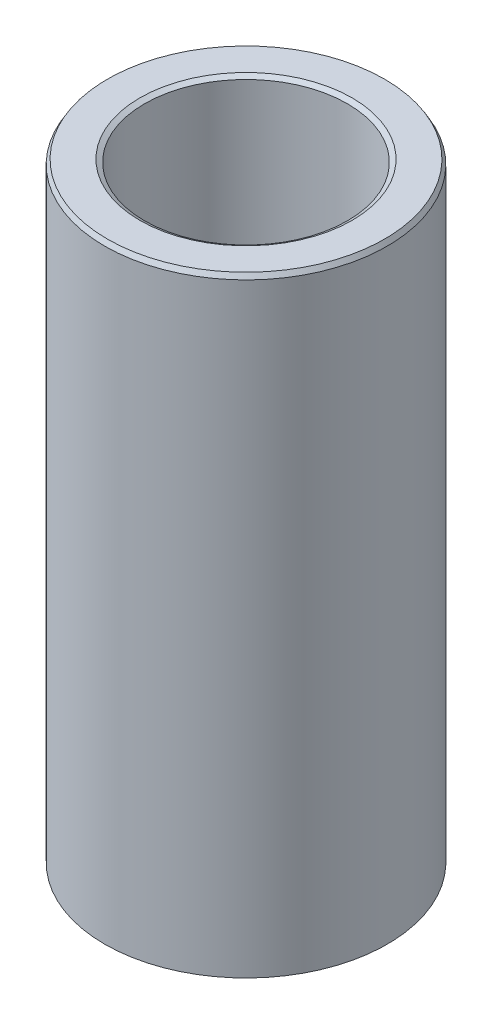
ISO-10303-21;
HEADER;
FILE_DESCRIPTION(('STEP AP214'),'2;1');
FILE_NAME('part.step','',(''),(''),'','','');
FILE_SCHEMA(('AUTOMOTIVE_DESIGN { 1 0 10303 214 1 1 1 1 }'));
ENDSEC;
DATA;
#1=APPLICATION_CONTEXT('core data for automotive mechanical design processes');
#2=APPLICATION_PROTOCOL_DEFINITION('international standard','automotive_design',2000,#1);
#3=PRODUCT_CONTEXT('',#1,'mechanical');
#4=PRODUCT('Part','Part','',(#3));
#5=PRODUCT_RELATED_PRODUCT_CATEGORY('part','',(#4));
#6=PRODUCT_DEFINITION_FORMATION('','',#4);
#7=PRODUCT_DEFINITION_CONTEXT('part definition',#1,'design');
#8=PRODUCT_DEFINITION('design','',#6,#7);
#9=PRODUCT_DEFINITION_SHAPE('','',#8);
#10=(LENGTH_UNIT() NAMED_UNIT(*) SI_UNIT(.MILLI.,.METRE.));
#11=(NAMED_UNIT(*) PLANE_ANGLE_UNIT() SI_UNIT($,.RADIAN.));
#12=(NAMED_UNIT(*) SI_UNIT($,.STERADIAN.) SOLID_ANGLE_UNIT());
#13=UNCERTAINTY_MEASURE_WITH_UNIT(LENGTH_MEASURE(1.E-05),#10,'distance_accuracy_value','');
#14=(GEOMETRIC_REPRESENTATION_CONTEXT(3) GLOBAL_UNCERTAINTY_ASSIGNED_CONTEXT((#13)) GLOBAL_UNIT_ASSIGNED_CONTEXT((#10,
#11,#12)) REPRESENTATION_CONTEXT('',''));
#15=CARTESIAN_POINT('',(0.,0.,0.));
#16=DIRECTION('',(0.,0.,1.));
#17=DIRECTION('',(1.,0.,0.));
#18=AXIS2_PLACEMENT_3D('',#15,#16,#17);
#19=CARTESIAN_POINT('',(0.,184.080786843945,0.));
#20=DIRECTION('',(0.,-1.,0.));
#21=DIRECTION('',(0.,0.,-1.));
#22=AXIS2_PLACEMENT_3D('',#19,#20,#21);
#23=CYLINDRICAL_SURFACE('',#22,42.5);
#24=CARTESIAN_POINT('',(0.,0.819974052406386,0.));
#25=DIRECTION('',(0.,1.,0.));
#26=DIRECTION('',(0.,0.,1.));
#27=AXIS2_PLACEMENT_3D('',#24,#25,#26);
#28=CIRCLE('',#27,42.5);
#29=CARTESIAN_POINT('',(0.,0.819974052406358,-42.5));
#30=VERTEX_POINT('',#29);
#31=EDGE_CURVE('E10',#30,#30,#28,.T.);
#32=CARTESIAN_POINT('',(0.,182.660550124289,0.));
#33=DIRECTION('',(0.,1.,0.));
#34=DIRECTION('',(0.,0.,1.));
#35=AXIS2_PLACEMENT_3D('',#32,#33,#34);
#36=CIRCLE('',#35,42.5);
#37=CARTESIAN_POINT('',(0.,182.660550124289,-42.5));
#38=VERTEX_POINT('',#37);
#39=EDGE_CURVE('E50',#38,#38,#36,.F.);
#40=CARTESIAN_POINT('',(0.,0.819974052406358,-42.5));
#41=CARTESIAN_POINT('',(0.,2.71414671982181,-42.5));
#42=CARTESIAN_POINT('',(0.,4.60831938723725,-42.5));
#43=CARTESIAN_POINT('',(0.,8.39666472206814,-42.5));
#44=CARTESIAN_POINT('',(0.,10.2908373894836,-42.5));
#45=CARTESIAN_POINT('',(0.,14.0791827243145,-42.5));
#46=CARTESIAN_POINT('',(0.,15.9733553917299,-42.5));
#47=CARTESIAN_POINT('',(0.,19.7617007265608,-42.5));
#48=CARTESIAN_POINT('',(0.,21.6558733939763,-42.5));
#49=CARTESIAN_POINT('',(0.,25.4442187288072,-42.5));
#50=CARTESIAN_POINT('',(0.,27.3383913962226,-42.5));
#51=CARTESIAN_POINT('',(0.,31.1267367310535,-42.5));
#52=CARTESIAN_POINT('',(0.,33.020909398469,-42.5));
#53=CARTESIAN_POINT('',(0.,36.8092547332999,-42.5));
#54=CARTESIAN_POINT('',(0.,38.7034274007153,-42.5));
#55=CARTESIAN_POINT('',(0.,42.4917727355462,-42.5));
#56=CARTESIAN_POINT('',(0.,44.3859454029617,-42.5));
#57=CARTESIAN_POINT('',(0.,48.1742907377926,-42.5));
#58=CARTESIAN_POINT('',(0.,50.068463405208,-42.5));
#59=CARTESIAN_POINT('',(0.,53.8568087400389,-42.5));
#60=CARTESIAN_POINT('',(0.,55.7509814074544,-42.5));
#61=CARTESIAN_POINT('',(0.,59.5393267422852,-42.5));
#62=CARTESIAN_POINT('',(0.,61.4334994097007,-42.5));
#63=CARTESIAN_POINT('',(0.,65.2218447445316,-42.5));
#64=CARTESIAN_POINT('',(0.,67.116017411947,-42.5));
#65=CARTESIAN_POINT('',(0.,70.9043627467779,-42.5));
#66=CARTESIAN_POINT('',(0.,72.7985354141934,-42.5));
#67=CARTESIAN_POINT('',(0.,76.5868807490243,-42.5));
#68=CARTESIAN_POINT('',(0.,78.4810534164397,-42.5));
#69=CARTESIAN_POINT('',(0.,82.2693987512706,-42.5));
#70=CARTESIAN_POINT('',(0.,84.1635714186861,-42.5));
#71=CARTESIAN_POINT('',(0.,87.951916753517,-42.5));
#72=CARTESIAN_POINT('',(0.,89.8460894209324,-42.5));
#73=CARTESIAN_POINT('',(0.,93.6344347557633,-42.5));
#74=CARTESIAN_POINT('',(0.,95.5286074231788,-42.5));
#75=CARTESIAN_POINT('',(0.,99.3169527580096,-42.5));
#76=CARTESIAN_POINT('',(0.,101.211125425425,-42.5));
#77=CARTESIAN_POINT('',(0.,104.999470760256,-42.5));
#78=CARTESIAN_POINT('',(0.,106.893643427671,-42.5));
#79=CARTESIAN_POINT('',(0.,110.681988762502,-42.5));
#80=CARTESIAN_POINT('',(0.,112.576161429918,-42.5));
#81=CARTESIAN_POINT('',(0.,116.364506764749,-42.5));
#82=CARTESIAN_POINT('',(0.,118.258679432164,-42.5));
#83=CARTESIAN_POINT('',(0.,122.047024766995,-42.5));
#84=CARTESIAN_POINT('',(0.,123.94119743441,-42.5));
#85=CARTESIAN_POINT('',(0.,127.729542769241,-42.5));
#86=CARTESIAN_POINT('',(0.,129.623715436657,-42.5));
#87=CARTESIAN_POINT('',(0.,133.412060771488,-42.5));
#88=CARTESIAN_POINT('',(0.,135.306233438903,-42.5));
#89=CARTESIAN_POINT('',(0.,139.094578773734,-42.5));
#90=CARTESIAN_POINT('',(0.,140.98875144115,-42.5));
#91=CARTESIAN_POINT('',(0.,144.77709677598,-42.5));
#92=CARTESIAN_POINT('',(0.,146.671269443396,-42.5));
#93=CARTESIAN_POINT('',(0.,150.459614778227,-42.5));
#94=CARTESIAN_POINT('',(0.,152.353787445642,-42.5));
#95=CARTESIAN_POINT('',(0.,156.142132780473,-42.5));
#96=CARTESIAN_POINT('',(0.,158.036305447889,-42.5));
#97=CARTESIAN_POINT('',(0.,161.824650782719,-42.5));
#98=CARTESIAN_POINT('',(0.,163.718823450135,-42.5));
#99=CARTESIAN_POINT('',(0.,167.507168784966,-42.5));
#100=CARTESIAN_POINT('',(0.,169.401341452381,-42.5));
#101=CARTESIAN_POINT('',(0.,173.189686787212,-42.5));
#102=CARTESIAN_POINT('',(0.,175.083859454628,-42.5));
#103=CARTESIAN_POINT('',(0.,178.872204789458,-42.5));
#104=CARTESIAN_POINT('',(0.,180.766377456874,-42.5));
#105=CARTESIAN_POINT('',(0.,182.660550124289,-42.5));
#106=B_SPLINE_CURVE_WITH_KNOTS('',3,(#40,#41,#42,#43,#44,#45,#46,#47,#48,#49,#50,#51,#52,#53,
#54,#55,#56,#57,#58,#59,#60,#61,#62,#63,#64,#65,#66,#67,#68,#69,#70,#71,#72,#73,#74,#75,#76,#77,
#78,#79,#80,#81,#82,#83,#84,#85,#86,#87,#88,#89,#90,#91,#92,#93,#94,#95,#96,#97,#98,#99,#100,
#101,#102,#103,#104,#105),.UNSPECIFIED.,.F.,.F.,(4,2,2,2,2,2,2,2,2,2,2,2,2,2,2,2,2,2,2,2,2,2,2,
2,2,2,2,2,2,2,2,2,4),(0.,5.68251800224634,11.3650360044927,17.047554006739,22.7300720089854,
28.4125900112317,34.0951080134781,39.7776260157244,45.4601440179708,51.1426620202171,
56.8251800224634,62.5076980247098,68.1902160269561,73.8727340292025,79.5552520314488,
85.2377700336952,90.9202880359415,96.6028060381878,102.285324040434,107.967842042681,
113.650360044927,119.332878047173,125.01539604942,130.697914051666,136.380432053912,
142.062950056159,147.745468058405,153.427986060651,159.110504062898,164.793022065144,
170.47554006739,176.158058069637,181.840576071883),.UNSPECIFIED.);
#107=EDGE_CURVE('BSEAM39',#30,#38,#106,.T.);
#108=ORIENTED_EDGE('',*,*,#31,.T.);
#109=ORIENTED_EDGE('',*,*,#39,.T.);
#110=ORIENTED_EDGE('',*,*,#107,.T.);
#111=ORIENTED_EDGE('',*,*,#107,.F.);
#112=EDGE_LOOP('',(#108,#110,#109,#111));
#113=FACE_BOUND('',#112,.T.);
#114=ADVANCED_FACE('F39',(#113),#23,.T.);
#115=CARTESIAN_POINT('',(0.,184.080786843945,0.));
#116=DIRECTION('',(0.,1.,0.));
#117=DIRECTION('',(0.,0.,1.));
#118=AXIS2_PLACEMENT_3D('',#115,#116,#117);
#119=PLANE('',#118);
#120=CARTESIAN_POINT('',(0.,184.080786843945,0.));
#121=DIRECTION('',(0.,1.,0.));
#122=DIRECTION('',(0.,0.,1.));
#123=AXIS2_PLACEMENT_3D('',#120,#121,#122);
#124=CIRCLE('',#123,31.9250883236727);
#125=CARTESIAN_POINT('',(0.,184.080786843945,31.9250883236727));
#126=VERTEX_POINT('',#125);
#127=EDGE_CURVE('E58',#126,#126,#124,.F.);
#128=ORIENTED_EDGE('',*,*,#127,.T.);
#129=EDGE_LOOP('',(#128));
#130=FACE_BOUND('',#129,.T.);
#131=CARTESIAN_POINT('',(0.,184.080786843945,0.));
#132=DIRECTION('',(0.,1.,0.));
#133=DIRECTION('',(0.,0.,1.));
#134=AXIS2_PLACEMENT_3D('',#131,#132,#133);
#135=CIRCLE('',#134,41.6800259475937);
#136=CARTESIAN_POINT('',(0.,184.080786843945,41.6800259475937));
#137=VERTEX_POINT('',#136);
#138=EDGE_CURVE('E61',#137,#137,#135,.T.);
#139=ORIENTED_EDGE('',*,*,#138,.T.);
#140=EDGE_LOOP('',(#139));
#141=FACE_BOUND('',#140,.T.);
#142=ADVANCED_FACE('F88',(#130,#141),#119,.T.);
#143=CARTESIAN_POINT('',(0.,0.,0.));
#144=DIRECTION('',(0.,1.,0.));
#145=DIRECTION('',(0.,0.,1.));
#146=AXIS2_PLACEMENT_3D('',#143,#144,#145);
#147=PLANE('',#146);
#148=CARTESIAN_POINT('',(0.,0.,0.));
#149=DIRECTION('',(0.,1.,0.));
#150=DIRECTION('',(0.,0.,1.));
#151=AXIS2_PLACEMENT_3D('',#148,#149,#150);
#152=CIRCLE('',#151,31.3248256564231);
#153=CARTESIAN_POINT('',(0.,0.,31.3248256564231));
#154=VERTEX_POINT('',#153);
#155=EDGE_CURVE('E51',#154,#154,#152,.T.);
#156=ORIENTED_EDGE('',*,*,#155,.T.);
#157=EDGE_LOOP('',(#156));
#158=FACE_BOUND('',#157,.T.);
#159=CARTESIAN_POINT('',(0.,0.,0.));
#160=DIRECTION('',(0.,1.,0.));
#161=DIRECTION('',(0.,0.,1.));
#162=AXIS2_PLACEMENT_3D('',#159,#160,#161);
#163=CIRCLE('',#162,41.079763280344);
#164=CARTESIAN_POINT('',(0.,0.,41.079763280344));
#165=VERTEX_POINT('',#164);
#166=EDGE_CURVE('E54',#165,#165,#163,.F.);
#167=ORIENTED_EDGE('',*,*,#166,.T.);
#168=EDGE_LOOP('',(#167));
#169=FACE_BOUND('',#168,.T.);
#170=ADVANCED_FACE('F83',(#158,#169),#147,.F.);
#171=CARTESIAN_POINT('',(0.,184.080786843945,0.));
#172=DIRECTION('',(0.,-1.,0.));
#173=DIRECTION('',(0.,0.,-1.));
#174=AXIS2_PLACEMENT_3D('',#171,#172,#173);
#175=CYLINDRICAL_SURFACE('',#174,30.5048516040168);
#176=CARTESIAN_POINT('',(0.,183.260812791539,0.));
#177=DIRECTION('',(0.,1.,0.));
#178=DIRECTION('',(0.,0.,1.));
#179=AXIS2_PLACEMENT_3D('',#176,#177,#178);
#180=CIRCLE('',#179,30.5048516040168);
#181=CARTESIAN_POINT('',(0.,183.260812791539,-30.5048516040168));
#182=VERTEX_POINT('',#181);
#183=EDGE_CURVE('E67',#182,#182,#180,.T.);
#184=CARTESIAN_POINT('',(0.,1.42023671965594,0.));
#185=DIRECTION('',(0.,1.,0.));
#186=DIRECTION('',(0.,0.,1.));
#187=AXIS2_PLACEMENT_3D('',#184,#185,#186);
#188=CIRCLE('',#187,30.5048516040168);
#189=CARTESIAN_POINT('',(0.,1.42023671965591,-30.5048516040168));
#190=VERTEX_POINT('',#189);
#191=EDGE_CURVE('E69',#190,#190,#188,.F.);
#192=CARTESIAN_POINT('',(0.,183.260812791539,-30.5048516040168));
#193=CARTESIAN_POINT('',(0.,181.366640124123,-30.5048516040168));
#194=CARTESIAN_POINT('',(0.,179.472467456708,-30.5048516040168));
#195=CARTESIAN_POINT('',(0.,175.684122121877,-30.5048516040168));
#196=CARTESIAN_POINT('',(0.,173.789949454462,-30.5048516040168));
#197=CARTESIAN_POINT('',(0.,170.001604119631,-30.5048516040168));
#198=CARTESIAN_POINT('',(0.,168.107431452215,-30.5048516040168));
#199=CARTESIAN_POINT('',(0.,164.319086117384,-30.5048516040168));
#200=CARTESIAN_POINT('',(0.,162.424913449969,-30.5048516040168));
#201=CARTESIAN_POINT('',(0.,158.636568115138,-30.5048516040168));
#202=CARTESIAN_POINT('',(0.,156.742395447723,-30.5048516040168));
#203=CARTESIAN_POINT('',(0.,152.954050112892,-30.5048516040168));
#204=CARTESIAN_POINT('',(0.,151.059877445476,-30.5048516040168));
#205=CARTESIAN_POINT('',(0.,147.271532110645,-30.5048516040168));
#206=CARTESIAN_POINT('',(0.,145.37735944323,-30.5048516040168));
#207=CARTESIAN_POINT('',(0.,141.589014108399,-30.5048516040168));
#208=CARTESIAN_POINT('',(0.,139.694841440984,-30.5048516040168));
#209=CARTESIAN_POINT('',(0.,135.906496106153,-30.5048516040168));
#210=CARTESIAN_POINT('',(0.,134.012323438737,-30.5048516040168));
#211=CARTESIAN_POINT('',(0.,130.223978103906,-30.5048516040168));
#212=CARTESIAN_POINT('',(0.,128.329805436491,-30.5048516040168));
#213=CARTESIAN_POINT('',(0.,124.54146010166,-30.5048516040168));
#214=CARTESIAN_POINT('',(0.,122.647287434245,-30.5048516040168));
#215=CARTESIAN_POINT('',(0.,118.858942099414,-30.5048516040168));
#216=CARTESIAN_POINT('',(0.,116.964769431998,-30.5048516040168));
#217=CARTESIAN_POINT('',(0.,113.176424097167,-30.5048516040168));
#218=CARTESIAN_POINT('',(0.,111.282251429752,-30.5048516040168));
#219=CARTESIAN_POINT('',(0.,107.493906094921,-30.5048516040168));
#220=CARTESIAN_POINT('',(0.,105.599733427505,-30.5048516040168));
#221=CARTESIAN_POINT('',(0.,101.811388092675,-30.5048516040168));
#222=CARTESIAN_POINT('',(0.,99.9172154252591,-30.5048516040168));
#223=CARTESIAN_POINT('',(0.,96.1288700904283,-30.5048516040168));
#224=CARTESIAN_POINT('',(0.,94.2346974230128,-30.5048516040168));
#225=CARTESIAN_POINT('',(0.,90.4463520881819,-30.5048516040168));
#226=CARTESIAN_POINT('',(0.,88.5521794207665,-30.5048516040168));
#227=CARTESIAN_POINT('',(0.,84.7638340859356,-30.5048516040168));
#228=CARTESIAN_POINT('',(0.,82.8696614185201,-30.5048516040168));
#229=CARTESIAN_POINT('',(0.,79.0813160836892,-30.5048516040168));
#230=CARTESIAN_POINT('',(0.,77.1871434162738,-30.5048516040168));
#231=CARTESIAN_POINT('',(0.,73.3987980814429,-30.5048516040168));
#232=CARTESIAN_POINT('',(0.,71.5046254140275,-30.5048516040168));
#233=CARTESIAN_POINT('',(0.,67.7162800791966,-30.5048516040168));
#234=CARTESIAN_POINT('',(0.,65.8221074117811,-30.5048516040168));
#235=CARTESIAN_POINT('',(0.,62.0337620769502,-30.5048516040168));
#236=CARTESIAN_POINT('',(0.,60.1395894095348,-30.5048516040168));
#237=CARTESIAN_POINT('',(0.,56.3512440747039,-30.5048516040168));
#238=CARTESIAN_POINT('',(0.,54.4570714072884,-30.5048516040168));
#239=CARTESIAN_POINT('',(0.,50.6687260724575,-30.5048516040168));
#240=CARTESIAN_POINT('',(0.,48.7745534050421,-30.5048516040168));
#241=CARTESIAN_POINT('',(0.,44.9862080702112,-30.5048516040168));
#242=CARTESIAN_POINT('',(0.,43.0920354027957,-30.5048516040168));
#243=CARTESIAN_POINT('',(0.,39.3036900679648,-30.5048516040168));
#244=CARTESIAN_POINT('',(0.,37.4095174005494,-30.5048516040168));
#245=CARTESIAN_POINT('',(0.,33.6211720657185,-30.5048516040168));
#246=CARTESIAN_POINT('',(0.,31.7269993983031,-30.5048516040168));
#247=CARTESIAN_POINT('',(0.,27.9386540634722,-30.5048516040168));
#248=CARTESIAN_POINT('',(0.,26.0444813960567,-30.5048516040168));
#249=CARTESIAN_POINT('',(0.,22.2561360612258,-30.5048516040168));
#250=CARTESIAN_POINT('',(0.,20.3619633938104,-30.5048516040168));
#251=CARTESIAN_POINT('',(0.,16.5736180589795,-30.5048516040168));
#252=CARTESIAN_POINT('',(0.,14.679445391564,-30.5048516040168));
#253=CARTESIAN_POINT('',(0.,10.8911000567331,-30.5048516040168));
#254=CARTESIAN_POINT('',(0.,8.9969273893177,-30.5048516040168));
#255=CARTESIAN_POINT('',(0.,5.2085820544868,-30.5048516040168));
#256=CARTESIAN_POINT('',(0.,3.31440938707136,-30.5048516040168));
#257=CARTESIAN_POINT('',(0.,1.42023671965591,-30.5048516040168));
#258=B_SPLINE_CURVE_WITH_KNOTS('',3,(#192,#193,#194,#195,#196,#197,#198,#199,#200,#201,#202,
#203,#204,#205,#206,#207,#208,#209,#210,#211,#212,#213,#214,#215,#216,#217,#218,#219,#220,#221,
#222,#223,#224,#225,#226,#227,#228,#229,#230,#231,#232,#233,#234,#235,#236,#237,#238,#239,#240,
#241,#242,#243,#244,#245,#246,#247,#248,#249,#250,#251,#252,#253,#254,#255,#256,#257),
.UNSPECIFIED.,.F.,.F.,(4,2,2,2,2,2,2,2,2,2,2,2,2,2,2,2,2,2,2,2,2,2,2,2,2,2,2,2,2,2,2,2,4),(0.,
5.68251800224634,11.3650360044927,17.047554006739,22.7300720089854,28.4125900112317,
34.095108013478,39.7776260157244,45.4601440179707,51.1426620202171,56.8251800224634,
62.5076980247097,68.1902160269561,73.8727340292024,79.5552520314488,85.2377700336951,
90.9202880359414,96.6028060381878,102.285324040434,107.96784204268,113.650360044927,
119.332878047173,125.015396049419,130.697914051666,136.380432053912,142.062950056159,
147.745468058405,153.427986060651,159.110504062898,164.793022065144,170.47554006739,
176.158058069637,181.840576071883),.UNSPECIFIED.);
#259=EDGE_CURVE('BSEAM71',#182,#190,#258,.T.);
#260=ORIENTED_EDGE('',*,*,#183,.T.);
#261=ORIENTED_EDGE('',*,*,#191,.T.);
#262=ORIENTED_EDGE('',*,*,#259,.T.);
#263=ORIENTED_EDGE('',*,*,#259,.F.);
#264=EDGE_LOOP('',(#260,#262,#261,#263));
#265=FACE_BOUND('',#264,.T.);
#266=ADVANCED_FACE('F71',(#265),#175,.F.);
#267=CARTESIAN_POINT('',(0.,183.260812791539,0.));
#268=DIRECTION('',(0.,1.,0.));
#269=DIRECTION('',(0.,0.,1.));
#270=AXIS2_PLACEMENT_3D('',#267,#268,#269);
#271=CONICAL_SURFACE('',#270,30.5048516040168,1.04719755119659);
#272=ORIENTED_EDGE('',*,*,#127,.F.);
#273=EDGE_LOOP('',(#272));
#274=FACE_BOUND('',#273,.T.);
#275=ORIENTED_EDGE('',*,*,#183,.F.);
#276=EDGE_LOOP('',(#275));
#277=FACE_BOUND('',#276,.T.);
#278=ADVANCED_FACE('F77',(#274,#277),#271,.F.);
#279=CARTESIAN_POINT('',(0.,0.,0.));
#280=DIRECTION('',(0.,-1.,0.));
#281=DIRECTION('',(0.,0.,-1.));
#282=AXIS2_PLACEMENT_3D('',#279,#280,#281);
#283=CONICAL_SURFACE('',#282,31.3248256564231,0.5235987755983);
#284=ORIENTED_EDGE('',*,*,#191,.F.);
#285=EDGE_LOOP('',(#284));
#286=FACE_BOUND('',#285,.T.);
#287=ORIENTED_EDGE('',*,*,#155,.F.);
#288=EDGE_LOOP('',(#287));
#289=FACE_BOUND('',#288,.T.);
#290=ADVANCED_FACE('F73',(#286,#289),#283,.F.);
#291=CARTESIAN_POINT('',(0.,0.819974052406386,0.));
#292=DIRECTION('',(0.,1.,0.));
#293=DIRECTION('',(0.,0.,1.));
#294=AXIS2_PLACEMENT_3D('',#291,#292,#293);
#295=CONICAL_SURFACE('',#294,42.5,1.0471975511966);
#296=ORIENTED_EDGE('',*,*,#166,.F.);
#297=EDGE_LOOP('',(#296));
#298=FACE_BOUND('',#297,.T.);
#299=ORIENTED_EDGE('',*,*,#31,.F.);
#300=EDGE_LOOP('',(#299));
#301=FACE_BOUND('',#300,.T.);
#302=ADVANCED_FACE('F76',(#298,#301),#295,.T.);
#303=CARTESIAN_POINT('',(0.,184.080786843945,0.));
#304=DIRECTION('',(0.,-1.,0.));
#305=DIRECTION('',(0.,0.,-1.));
#306=AXIS2_PLACEMENT_3D('',#303,#304,#305);
#307=CONICAL_SURFACE('',#306,41.6800259475937,0.523598775598306);
#308=ORIENTED_EDGE('',*,*,#39,.F.);
#309=EDGE_LOOP('',(#308));
#310=FACE_BOUND('',#309,.T.);
#311=ORIENTED_EDGE('',*,*,#138,.F.);
#312=EDGE_LOOP('',(#311));
#313=FACE_BOUND('',#312,.T.);
#314=ADVANCED_FACE('F45',(#310,#313),#307,.T.);
#315=CLOSED_SHELL('',(#114,#142,#170,#266,#278,#290,#302,#314));
#316=MANIFOLD_SOLID_BREP('B2',#315);
#317=ADVANCED_BREP_SHAPE_REPRESENTATION('',(#18,#316),#14);
#318=SHAPE_DEFINITION_REPRESENTATION(#9,#317);
ENDSEC;
END-ISO-10303-21;
